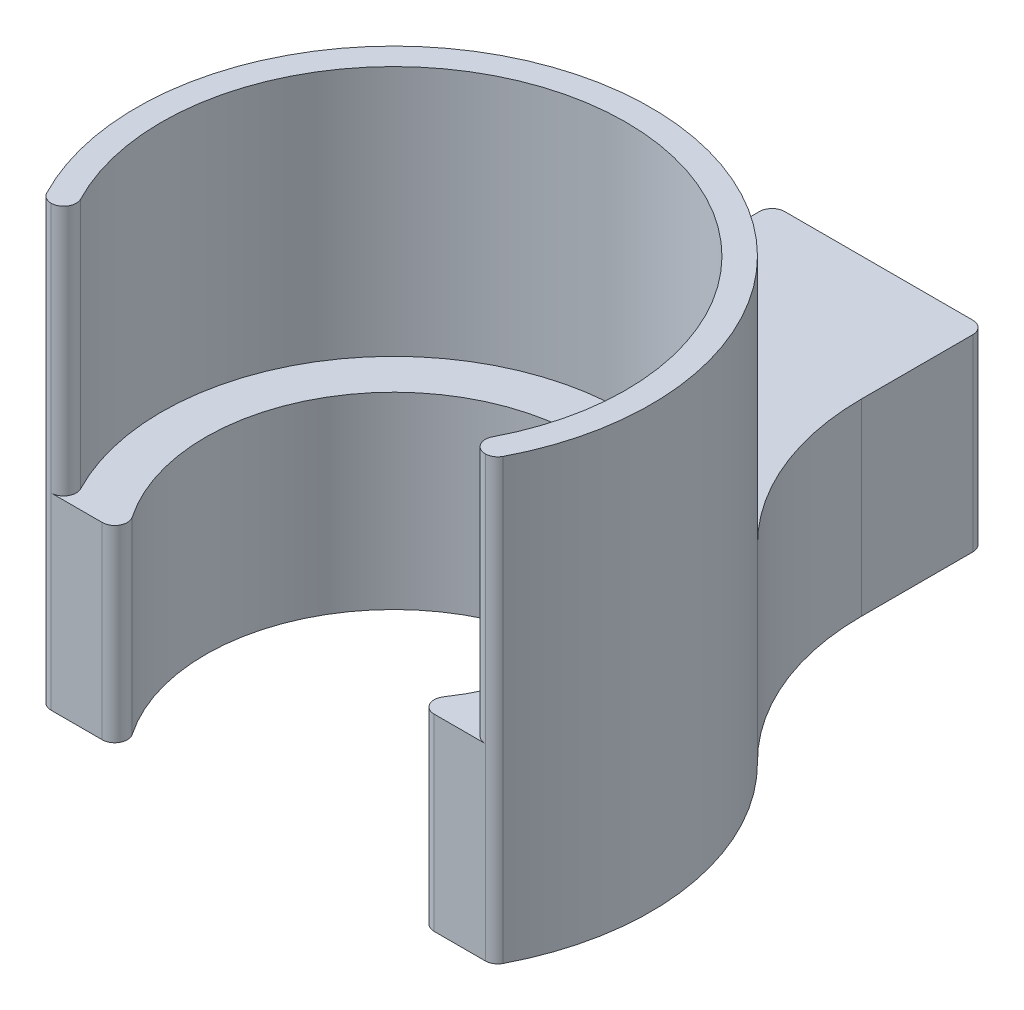
ISO-10303-21;
HEADER;
FILE_DESCRIPTION(('STEP AP214'),'2;1');
FILE_NAME('part.step','',(''),(''),'','','');
FILE_SCHEMA(('AUTOMOTIVE_DESIGN { 1 0 10303 214 1 1 1 1 }'));
ENDSEC;
DATA;
#1=APPLICATION_CONTEXT('core data for automotive mechanical design processes');
#2=APPLICATION_PROTOCOL_DEFINITION('international standard','automotive_design',2000,#1);
#3=PRODUCT_CONTEXT('',#1,'mechanical');
#4=PRODUCT('Part','Part','',(#3));
#5=PRODUCT_RELATED_PRODUCT_CATEGORY('part','',(#4));
#6=PRODUCT_DEFINITION_FORMATION('','',#4);
#7=PRODUCT_DEFINITION_CONTEXT('part definition',#1,'design');
#8=PRODUCT_DEFINITION('design','',#6,#7);
#9=PRODUCT_DEFINITION_SHAPE('','',#8);
#10=(LENGTH_UNIT() NAMED_UNIT(*) SI_UNIT(.MILLI.,.METRE.));
#11=(NAMED_UNIT(*) PLANE_ANGLE_UNIT() SI_UNIT($,.RADIAN.));
#12=(NAMED_UNIT(*) SI_UNIT($,.STERADIAN.) SOLID_ANGLE_UNIT());
#13=UNCERTAINTY_MEASURE_WITH_UNIT(LENGTH_MEASURE(1.E-05),#10,'distance_accuracy_value','');
#14=(GEOMETRIC_REPRESENTATION_CONTEXT(3) GLOBAL_UNCERTAINTY_ASSIGNED_CONTEXT((#13)) GLOBAL_UNIT_ASSIGNED_CONTEXT((#10,
#11,#12)) REPRESENTATION_CONTEXT('',''));
#15=CARTESIAN_POINT('',(0.,0.,0.));
#16=DIRECTION('',(0.,0.,1.));
#17=DIRECTION('',(1.,0.,0.));
#18=AXIS2_PLACEMENT_3D('',#15,#16,#17);
#19=CARTESIAN_POINT('',(8.5,-7.5,20.));
#20=DIRECTION('',(-1.,0.,0.));
#21=DIRECTION('',(0.,0.,1.));
#22=AXIS2_PLACEMENT_3D('',#19,#20,#21);
#23=PLANE('',#22);
#24=DIRECTION('',(0.,0.,-1.));
#25=VECTOR('',#24,1.);
#26=CARTESIAN_POINT('',(8.5,-7.5,20.));
#27=LINE('',#26,#25);
#28=CARTESIAN_POINT('',(8.5,-7.5,9.87976896630131));
#29=VERTEX_POINT('',#28);
#30=CARTESIAN_POINT('',(8.5,-7.5,1.));
#31=VERTEX_POINT('',#30);
#32=EDGE_CURVE('E207',#29,#31,#27,.T.);
#33=ORIENTED_EDGE('',*,*,#32,.T.);
#34=DIRECTION('',(0.,1.,0.));
#35=VECTOR('',#34,1.);
#36=CARTESIAN_POINT('',(8.5,7.5,1.));
#37=LINE('',#36,#35);
#38=CARTESIAN_POINT('',(8.5,7.5,1.));
#39=VERTEX_POINT('',#38);
#40=EDGE_CURVE('E337',#31,#39,#37,.T.);
#41=ORIENTED_EDGE('',*,*,#40,.T.);
#42=DIRECTION('',(0.,0.,-1.));
#43=VECTOR('',#42,1.);
#44=CARTESIAN_POINT('',(8.5,7.5,20.));
#45=LINE('',#44,#43);
#46=CARTESIAN_POINT('',(8.5,7.5,9.87976896630131));
#47=VERTEX_POINT('',#46);
#48=EDGE_CURVE('E219',#47,#39,#45,.T.);
#49=ORIENTED_EDGE('',*,*,#48,.F.);
#50=DIRECTION('',(0.,1.,0.));
#51=VECTOR('',#50,1.);
#52=CARTESIAN_POINT('',(8.5,-7.5,9.87976896630131));
#53=LINE('',#52,#51);
#54=EDGE_CURVE('E235',#47,#29,#53,.F.);
#55=ORIENTED_EDGE('',*,*,#54,.T.);
#56=EDGE_LOOP('',(#33,#41,#49,#55));
#57=FACE_BOUND('',#56,.T.);
#58=ADVANCED_FACE('F43',(#57),#23,.F.);
#59=CARTESIAN_POINT('',(-8.5,7.5,20.));
#60=DIRECTION('',(0.,-1.,0.));
#61=DIRECTION('',(0.,0.,-1.));
#62=AXIS2_PLACEMENT_3D('',#59,#60,#61);
#63=PLANE('',#62);
#64=DIRECTION('',(-1.,0.,0.));
#65=VECTOR('',#64,1.);
#66=CARTESIAN_POINT('',(-8.5,7.5,0.));
#67=LINE('',#66,#65);
#68=CARTESIAN_POINT('',(7.5,7.5,0.));
#69=VERTEX_POINT('',#68);
#70=CARTESIAN_POINT('',(-7.5,7.5,0.));
#71=VERTEX_POINT('',#70);
#72=EDGE_CURVE('E192',#69,#71,#67,.T.);
#73=ORIENTED_EDGE('',*,*,#72,.T.);
#74=CARTESIAN_POINT('',(-7.5,7.5,1.));
#75=DIRECTION('',(0.,-1.,0.));
#76=DIRECTION('',(0.,0.,-1.));
#77=AXIS2_PLACEMENT_3D('',#74,#75,#76);
#78=CIRCLE('',#77,1.);
#79=CARTESIAN_POINT('',(-8.5,7.5,1.));
#80=VERTEX_POINT('',#79);
#81=EDGE_CURVE('E334',#71,#80,#78,.F.);
#82=ORIENTED_EDGE('',*,*,#81,.T.);
#83=DIRECTION('',(0.,0.,-1.));
#84=VECTOR('',#83,1.);
#85=CARTESIAN_POINT('',(-8.5,7.5,20.));
#86=LINE('',#85,#84);
#87=CARTESIAN_POINT('',(-8.5,7.5,9.87976896630131));
#88=VERTEX_POINT('',#87);
#89=EDGE_CURVE('E215',#88,#80,#86,.T.);
#90=ORIENTED_EDGE('',*,*,#89,.F.);
#91=CARTESIAN_POINT('',(-28.5,7.5,9.87976896630131));
#92=DIRECTION('',(0.,-1.,0.));
#93=DIRECTION('',(0.,0.,-1.));
#94=AXIS2_PLACEMENT_3D('',#91,#92,#93);
#95=CIRCLE('',#94,20.);
#96=CARTESIAN_POINT('',(-14.4259259259259,7.5,24.0896401464871));
#97=VERTEX_POINT('',#96);
#98=EDGE_CURVE('E241',#88,#97,#95,.T.);
#99=ORIENTED_EDGE('',*,*,#98,.T.);
#100=CARTESIAN_POINT('',(0.,7.5,38.6547581061776));
#101=DIRECTION('',(0.,1.,0.));
#102=DIRECTION('',(0.,0.,1.));
#103=AXIS2_PLACEMENT_3D('',#100,#101,#102);
#104=CIRCLE('',#103,20.5);
#105=CARTESIAN_POINT('',(14.4259259259259,7.5,24.0896401464871));
#106=VERTEX_POINT('',#105);
#107=EDGE_CURVE('E223',#106,#97,#104,.T.);
#108=ORIENTED_EDGE('',*,*,#107,.F.);
#109=CARTESIAN_POINT('',(28.5,7.5,9.87976896630131));
#110=DIRECTION('',(0.,-1.,0.));
#111=DIRECTION('',(0.,0.,-1.));
#112=AXIS2_PLACEMENT_3D('',#109,#110,#111);
#113=CIRCLE('',#112,20.);
#114=EDGE_CURVE('E245',#106,#47,#113,.T.);
#115=ORIENTED_EDGE('',*,*,#114,.T.);
#116=ORIENTED_EDGE('',*,*,#48,.T.);
#117=CARTESIAN_POINT('',(7.5,7.5,1.));
#118=DIRECTION('',(0.,-1.,0.));
#119=DIRECTION('',(0.,0.,-1.));
#120=AXIS2_PLACEMENT_3D('',#117,#118,#119);
#121=CIRCLE('',#120,1.);
#122=EDGE_CURVE('E61',#39,#69,#121,.F.);
#123=ORIENTED_EDGE('',*,*,#122,.T.);
#124=EDGE_LOOP('',(#73,#82,#90,#99,#108,#115,#116,#123));
#125=FACE_BOUND('',#124,.T.);
#126=ADVANCED_FACE('F423',(#125),#63,.F.);
#127=CARTESIAN_POINT('',(-8.5,-7.5,20.));
#128=DIRECTION('',(1.,0.,0.));
#129=DIRECTION('',(0.,0.,-1.));
#130=AXIS2_PLACEMENT_3D('',#127,#128,#129);
#131=PLANE('',#130);
#132=ORIENTED_EDGE('',*,*,#89,.T.);
#133=DIRECTION('',(0.,-1.,0.));
#134=VECTOR('',#133,1.);
#135=CARTESIAN_POINT('',(-8.5,-7.5,1.));
#136=LINE('',#135,#134);
#137=CARTESIAN_POINT('',(-8.5,-7.5,1.));
#138=VERTEX_POINT('',#137);
#139=EDGE_CURVE('E323',#80,#138,#136,.T.);
#140=ORIENTED_EDGE('',*,*,#139,.T.);
#141=DIRECTION('',(0.,0.,-1.));
#142=VECTOR('',#141,1.);
#143=CARTESIAN_POINT('',(-8.5,-7.5,20.));
#144=LINE('',#143,#142);
#145=CARTESIAN_POINT('',(-8.5,-7.5,9.87976896630131));
#146=VERTEX_POINT('',#145);
#147=EDGE_CURVE('E211',#146,#138,#144,.T.);
#148=ORIENTED_EDGE('',*,*,#147,.F.);
#149=DIRECTION('',(0.,1.,0.));
#150=VECTOR('',#149,1.);
#151=CARTESIAN_POINT('',(-8.5,7.5,9.87976896630131));
#152=LINE('',#151,#150);
#153=EDGE_CURVE('E232',#146,#88,#152,.T.);
#154=ORIENTED_EDGE('',*,*,#153,.T.);
#155=EDGE_LOOP('',(#132,#140,#148,#154));
#156=FACE_BOUND('',#155,.T.);
#157=ADVANCED_FACE('F429',(#156),#131,.F.);
#158=CARTESIAN_POINT('',(-8.5,-7.5,20.));
#159=DIRECTION('',(0.,1.,0.));
#160=DIRECTION('',(0.,0.,1.));
#161=AXIS2_PLACEMENT_3D('',#158,#159,#160);
#162=PLANE('',#161);
#163=CARTESIAN_POINT('',(0.,-7.5,38.6547581061776));
#164=DIRECTION('',(0.,1.,0.));
#165=DIRECTION('',(0.,0.,1.));
#166=AXIS2_PLACEMENT_3D('',#163,#164,#165);
#167=CIRCLE('',#166,20.5);
#168=CARTESIAN_POINT('',(18.1859640915963,-7.5,48.1162965677161));
#169=VERTEX_POINT('',#168);
#170=CARTESIAN_POINT('',(14.4259259259259,-7.5,24.0896401464871));
#171=VERTEX_POINT('',#170);
#172=EDGE_CURVE('E395',#169,#171,#167,.T.);
#173=ORIENTED_EDGE('',*,*,#172,.F.);
#174=CARTESIAN_POINT('',(17.2988438920062,-7.5,47.6547581061776));
#175=DIRECTION('',(0.,1.,0.));
#176=DIRECTION('',(0.,0.,1.));
#177=AXIS2_PLACEMENT_3D('',#174,#175,#176);
#178=CIRCLE('',#177,1.);
#179=CARTESIAN_POINT('',(17.2988438920062,-7.5,48.6547581061776));
#180=VERTEX_POINT('',#179);
#181=EDGE_CURVE('E274',#169,#180,#178,.F.);
#182=ORIENTED_EDGE('',*,*,#181,.T.);
#183=DIRECTION('',(1.,0.,0.));
#184=VECTOR('',#183,1.);
#185=CARTESIAN_POINT('',(15.5643824162734,-7.5,48.6547581061776));
#186=LINE('',#185,#184);
#187=CARTESIAN_POINT('',(13.228756555323,-7.5,48.6547581061776));
#188=VERTEX_POINT('',#187);
#189=EDGE_CURVE('E388',#188,#180,#186,.T.);
#190=ORIENTED_EDGE('',*,*,#189,.F.);
#191=CARTESIAN_POINT('',(13.228756555323,-7.5,47.6547581061776));
#192=DIRECTION('',(0.,1.,0.));
#193=DIRECTION('',(0.,0.,1.));
#194=AXIS2_PLACEMENT_3D('',#191,#192,#193);
#195=CIRCLE('',#194,1.);
#196=CARTESIAN_POINT('',(12.4019592706153,-7.5,47.0922581061776));
#197=VERTEX_POINT('',#196);
#198=EDGE_CURVE('E271',#188,#197,#195,.F.);
#199=ORIENTED_EDGE('',*,*,#198,.T.);
#200=CARTESIAN_POINT('',(0.,-7.5,38.6547581061776));
#201=DIRECTION('',(0.,1.,0.));
#202=DIRECTION('',(0.,0.,1.));
#203=AXIS2_PLACEMENT_3D('',#200,#201,#202);
#204=CIRCLE('',#203,15.);
#205=CARTESIAN_POINT('',(-12.4019592706153,-7.5,47.0922581061776));
#206=VERTEX_POINT('',#205);
#207=EDGE_CURVE('E382',#206,#197,#204,.F.);
#208=ORIENTED_EDGE('',*,*,#207,.F.);
#209=CARTESIAN_POINT('',(-13.228756555323,-7.5,47.6547581061776));
#210=DIRECTION('',(0.,1.,0.));
#211=DIRECTION('',(0.,0.,1.));
#212=AXIS2_PLACEMENT_3D('',#209,#210,#211);
#213=CIRCLE('',#212,1.);
#214=CARTESIAN_POINT('',(-13.228756555323,-7.5,48.6547581061776));
#215=VERTEX_POINT('',#214);
#216=EDGE_CURVE('E268',#206,#215,#213,.F.);
#217=ORIENTED_EDGE('',*,*,#216,.T.);
#218=DIRECTION('',(1.,0.,0.));
#219=VECTOR('',#218,1.);
#220=CARTESIAN_POINT('',(-15.5643824162734,-7.5,48.6547581061776));
#221=LINE('',#220,#219);
#222=CARTESIAN_POINT('',(-17.2988438920062,-7.5,48.6547581061776));
#223=VERTEX_POINT('',#222);
#224=EDGE_CURVE('E370',#223,#215,#221,.T.);
#225=ORIENTED_EDGE('',*,*,#224,.F.);
#226=CARTESIAN_POINT('',(-17.2988438920062,-7.5,47.6547581061776));
#227=DIRECTION('',(0.,1.,0.));
#228=DIRECTION('',(0.,0.,1.));
#229=AXIS2_PLACEMENT_3D('',#226,#227,#228);
#230=CIRCLE('',#229,1.);
#231=CARTESIAN_POINT('',(-18.1859640915963,-7.5,48.1162965677161));
#232=VERTEX_POINT('',#231);
#233=EDGE_CURVE('E265',#223,#232,#230,.F.);
#234=ORIENTED_EDGE('',*,*,#233,.T.);
#235=CARTESIAN_POINT('',(0.,-7.5,38.6547581061776));
#236=DIRECTION('',(0.,1.,0.));
#237=DIRECTION('',(0.,0.,1.));
#238=AXIS2_PLACEMENT_3D('',#235,#236,#237);
#239=CIRCLE('',#238,20.5);
#240=CARTESIAN_POINT('',(-14.4259259259259,-7.5,24.0896401464871));
#241=VERTEX_POINT('',#240);
#242=EDGE_CURVE('E383',#241,#232,#239,.T.);
#243=ORIENTED_EDGE('',*,*,#242,.F.);
#244=CARTESIAN_POINT('',(-28.5,-7.5,9.87976896630131));
#245=DIRECTION('',(0.,1.,0.));
#246=DIRECTION('',(0.,0.,1.));
#247=AXIS2_PLACEMENT_3D('',#244,#245,#246);
#248=CIRCLE('',#247,20.);
#249=EDGE_CURVE('E238',#241,#146,#248,.T.);
#250=ORIENTED_EDGE('',*,*,#249,.T.);
#251=ORIENTED_EDGE('',*,*,#147,.T.);
#252=CARTESIAN_POINT('',(-7.5,-7.5,1.));
#253=DIRECTION('',(0.,1.,0.));
#254=DIRECTION('',(0.,0.,1.));
#255=AXIS2_PLACEMENT_3D('',#252,#253,#254);
#256=CIRCLE('',#255,1.);
#257=CARTESIAN_POINT('',(-7.5,-7.5,0.));
#258=VERTEX_POINT('',#257);
#259=EDGE_CURVE('E262',#138,#258,#256,.F.);
#260=ORIENTED_EDGE('',*,*,#259,.T.);
#261=DIRECTION('',(1.,0.,0.));
#262=VECTOR('',#261,1.);
#263=CARTESIAN_POINT('',(-8.5,-7.5,0.));
#264=LINE('',#263,#262);
#265=CARTESIAN_POINT('',(7.5,-7.5,0.));
#266=VERTEX_POINT('',#265);
#267=EDGE_CURVE('E197',#258,#266,#264,.T.);
#268=ORIENTED_EDGE('',*,*,#267,.T.);
#269=CARTESIAN_POINT('',(7.5,-7.5,1.));
#270=DIRECTION('',(0.,1.,0.));
#271=DIRECTION('',(0.,0.,1.));
#272=AXIS2_PLACEMENT_3D('',#269,#270,#271);
#273=CIRCLE('',#272,1.);
#274=EDGE_CURVE('E259',#266,#31,#273,.F.);
#275=ORIENTED_EDGE('',*,*,#274,.T.);
#276=ORIENTED_EDGE('',*,*,#32,.F.);
#277=CARTESIAN_POINT('',(28.5,-7.5,9.87976896630131));
#278=DIRECTION('',(0.,1.,0.));
#279=DIRECTION('',(0.,0.,1.));
#280=AXIS2_PLACEMENT_3D('',#277,#278,#279);
#281=CIRCLE('',#280,20.);
#282=EDGE_CURVE('E248',#29,#171,#281,.T.);
#283=ORIENTED_EDGE('',*,*,#282,.T.);
#284=EDGE_LOOP('',(#173,#182,#190,#199,#208,#217,#225,#234,#243,#250,#251,#260,#268,#275,#276,#283));
#285=FACE_BOUND('',#284,.T.);
#286=ADVANCED_FACE('F376',(#285),#162,.F.);
#287=CARTESIAN_POINT('',(0.,0.,0.));
#288=DIRECTION('',(0.,0.,-1.));
#289=DIRECTION('',(-1.,0.,0.));
#290=AXIS2_PLACEMENT_3D('',#287,#288,#289);
#291=PLANE('',#290);
#292=CARTESIAN_POINT('',(0.,0.,0.));
#293=DIRECTION('',(0.,0.,-1.));
#294=DIRECTION('',(-1.,0.,0.));
#295=AXIS2_PLACEMENT_3D('',#292,#293,#294);
#296=CIRCLE('',#295,2.49999999999999);
#297=CARTESIAN_POINT('',(-2.49999999999999,0.,0.));
#298=VERTEX_POINT('',#297);
#299=EDGE_CURVE('E193',#298,#298,#296,.T.);
#300=ORIENTED_EDGE('',*,*,#299,.F.);
#301=EDGE_LOOP('',(#300));
#302=FACE_BOUND('',#301,.T.);
#303=ORIENTED_EDGE('',*,*,#267,.F.);
#304=DIRECTION('',(0.,-1.,0.));
#305=VECTOR('',#304,1.);
#306=CARTESIAN_POINT('',(-7.5,7.5,0.));
#307=LINE('',#306,#305);
#308=EDGE_CURVE('E69',#258,#71,#307,.F.);
#309=ORIENTED_EDGE('',*,*,#308,.T.);
#310=ORIENTED_EDGE('',*,*,#72,.F.);
#311=DIRECTION('',(0.,1.,0.));
#312=VECTOR('',#311,1.);
#313=CARTESIAN_POINT('',(7.5,-7.5,0.));
#314=LINE('',#313,#312);
#315=EDGE_CURVE('E327',#69,#266,#314,.F.);
#316=ORIENTED_EDGE('',*,*,#315,.T.);
#317=EDGE_LOOP('',(#303,#309,#310,#316));
#318=FACE_BOUND('',#317,.T.);
#319=ADVANCED_FACE('F185',(#302,#318),#291,.T.);
#320=CARTESIAN_POINT('',(0.,0.,10.));
#321=DIRECTION('',(0.,0.,-1.));
#322=DIRECTION('',(-1.,0.,0.));
#323=AXIS2_PLACEMENT_3D('',#320,#321,#322);
#324=CONICAL_SURFACE('',#323,2.5,1.02974425867665);
#325=CARTESIAN_POINT('',(0.,0.,11.5021515475689));
#326=VERTEX_POINT('',#325);
#327=VERTEX_LOOP('',#326);
#328=FACE_BOUND('',#327,.T.);
#329=CARTESIAN_POINT('',(0.,0.,10.));
#330=DIRECTION('',(0.,0.,-1.));
#331=DIRECTION('',(-1.,0.,0.));
#332=AXIS2_PLACEMENT_3D('',#329,#330,#331);
#333=CIRCLE('',#332,2.5);
#334=CARTESIAN_POINT('',(-2.5,0.,10.));
#335=VERTEX_POINT('',#334);
#336=EDGE_CURVE('E189',#335,#335,#333,.T.);
#337=ORIENTED_EDGE('',*,*,#336,.T.);
#338=EDGE_LOOP('',(#337));
#339=FACE_BOUND('',#338,.T.);
#340=ADVANCED_FACE('F181',(#328,#339),#324,.F.);
#341=CARTESIAN_POINT('',(0.,0.,0.));
#342=DIRECTION('',(0.,0.,-1.));
#343=DIRECTION('',(-1.,0.,0.));
#344=AXIS2_PLACEMENT_3D('',#341,#342,#343);
#345=CYLINDRICAL_SURFACE('',#344,2.49999999999999);
#346=ORIENTED_EDGE('',*,*,#336,.F.);
#347=EDGE_LOOP('',(#346));
#348=FACE_BOUND('',#347,.T.);
#349=ORIENTED_EDGE('',*,*,#299,.T.);
#350=EDGE_LOOP('',(#349));
#351=FACE_BOUND('',#350,.T.);
#352=ADVANCED_FACE('F184',(#348,#351),#345,.F.);
#353=CARTESIAN_POINT('',(0.,27.5,38.6547581061776));
#354=DIRECTION('',(0.,-1.,0.));
#355=DIRECTION('',(0.,0.,-1.));
#356=AXIS2_PLACEMENT_3D('',#353,#354,#355);
#357=CYLINDRICAL_SURFACE('',#356,18.5);
#358=CARTESIAN_POINT('',(0.,7.5,38.6547581061776));
#359=DIRECTION('',(0.,-1.,0.));
#360=DIRECTION('',(0.,0.,1.));
#361=AXIS2_PLACEMENT_3D('',#358,#359,#360);
#362=CIRCLE('',#361,18.5);
#363=CARTESIAN_POINT('',(-16.4117236924161,7.5,47.1932196446392));
#364=VERTEX_POINT('',#363);
#365=CARTESIAN_POINT('',(16.4117236924161,7.5,47.1932196446392));
#366=VERTEX_POINT('',#365);
#367=EDGE_CURVE('E397',#364,#366,#362,.T.);
#368=ORIENTED_EDGE('',*,*,#367,.T.);
#369=DIRECTION('',(0.,-1.,0.));
#370=VECTOR('',#369,1.);
#371=CARTESIAN_POINT('',(16.4117236924161,27.5,47.1932196446392));
#372=LINE('',#371,#370);
#373=CARTESIAN_POINT('',(16.4117236924161,27.5,47.1932196446392));
#374=VERTEX_POINT('',#373);
#375=EDGE_CURVE('E300',#366,#374,#372,.F.);
#376=ORIENTED_EDGE('',*,*,#375,.T.);
#377=CARTESIAN_POINT('',(0.,27.5,38.6547581061776));
#378=DIRECTION('',(0.,-1.,0.));
#379=DIRECTION('',(0.,0.,1.));
#380=AXIS2_PLACEMENT_3D('',#377,#378,#379);
#381=CIRCLE('',#380,18.5);
#382=CARTESIAN_POINT('',(-16.4117236924161,27.5,47.1932196446392));
#383=VERTEX_POINT('',#382);
#384=EDGE_CURVE('E404',#383,#374,#381,.T.);
#385=ORIENTED_EDGE('',*,*,#384,.F.);
#386=DIRECTION('',(0.,-1.,0.));
#387=VECTOR('',#386,1.);
#388=CARTESIAN_POINT('',(-16.4117236924161,27.5,47.1932196446392));
#389=LINE('',#388,#387);
#390=EDGE_CURVE('E296',#383,#364,#389,.T.);
#391=ORIENTED_EDGE('',*,*,#390,.T.);
#392=EDGE_LOOP('',(#368,#376,#385,#391));
#393=FACE_BOUND('',#392,.T.);
#394=ADVANCED_FACE('F458',(#393),#357,.F.);
#395=CARTESIAN_POINT('',(15.5643824162734,27.5,48.6547581061776));
#396=DIRECTION('',(0.,0.,-1.));
#397=DIRECTION('',(-1.,0.,0.));
#398=AXIS2_PLACEMENT_3D('',#395,#396,#397);
#399=PLANE('',#398);
#400=ORIENTED_EDGE('',*,*,#189,.T.);
#401=DIRECTION('',(0.,-1.,0.));
#402=VECTOR('',#401,1.);
#403=CARTESIAN_POINT('',(17.2988438920062,27.5,48.6547581061776));
#404=LINE('',#403,#402);
#405=CARTESIAN_POINT('',(17.2988438920062,7.5,48.6547581061776));
#406=VERTEX_POINT('',#405);
#407=EDGE_CURVE('E280',#180,#406,#404,.F.);
#408=ORIENTED_EDGE('',*,*,#407,.T.);
#409=DIRECTION('',(-1.,0.,0.));
#410=VECTOR('',#409,1.);
#411=CARTESIAN_POINT('',(15.5643824162734,7.5,48.6547581061776));
#412=LINE('',#411,#410);
#413=CARTESIAN_POINT('',(13.228756555323,7.5,48.6547581061776));
#414=VERTEX_POINT('',#413);
#415=EDGE_CURVE('E344',#406,#414,#412,.T.);
#416=ORIENTED_EDGE('',*,*,#415,.T.);
#417=DIRECTION('',(0.,1.,0.));
#418=VECTOR('',#417,1.);
#419=CARTESIAN_POINT('',(13.228756555323,27.5,48.6547581061776));
#420=LINE('',#419,#418);
#421=EDGE_CURVE('E277',#414,#188,#420,.F.);
#422=ORIENTED_EDGE('',*,*,#421,.T.);
#423=EDGE_LOOP('',(#400,#408,#416,#422));
#424=FACE_BOUND('',#423,.T.);
#425=ADVANCED_FACE('F447',(#424),#399,.F.);
#426=CARTESIAN_POINT('',(0.,27.5,38.6547581061776));
#427=DIRECTION('',(0.,-1.,0.));
#428=DIRECTION('',(0.,0.,-1.));
#429=AXIS2_PLACEMENT_3D('',#426,#427,#428);
#430=CYLINDRICAL_SURFACE('',#429,20.5);
#431=CARTESIAN_POINT('',(0.,27.5,38.6547581061776));
#432=DIRECTION('',(0.,1.,0.));
#433=DIRECTION('',(0.,0.,1.));
#434=AXIS2_PLACEMENT_3D('',#431,#432,#433);
#435=CIRCLE('',#434,20.5);
#436=CARTESIAN_POINT('',(18.1859640915963,27.5,48.1162965677161));
#437=VERTEX_POINT('',#436);
#438=CARTESIAN_POINT('',(-18.1859640915963,27.5,48.1162965677161));
#439=VERTEX_POINT('',#438);
#440=EDGE_CURVE('E200',#437,#439,#435,.T.);
#441=ORIENTED_EDGE('',*,*,#440,.F.);
#442=DIRECTION('',(0.,-1.,0.));
#443=VECTOR('',#442,1.);
#444=CARTESIAN_POINT('',(18.1859640915963,27.5,48.1162965677161));
#445=LINE('',#444,#443);
#446=EDGE_CURVE('E255',#437,#169,#445,.T.);
#447=ORIENTED_EDGE('',*,*,#446,.T.);
#448=ORIENTED_EDGE('',*,*,#172,.T.);
#449=DIRECTION('',(0.,-1.,0.));
#450=VECTOR('',#449,1.);
#451=CARTESIAN_POINT('',(14.4259259259259,27.5,24.0896401464871));
#452=LINE('',#451,#450);
#453=EDGE_CURVE('E224',#171,#106,#452,.F.);
#454=ORIENTED_EDGE('',*,*,#453,.T.);
#455=ORIENTED_EDGE('',*,*,#107,.T.);
#456=DIRECTION('',(0.,-1.,0.));
#457=VECTOR('',#456,1.);
#458=CARTESIAN_POINT('',(-14.4259259259259,27.5,24.0896401464871));
#459=LINE('',#458,#457);
#460=EDGE_CURVE('E228',#97,#241,#459,.T.);
#461=ORIENTED_EDGE('',*,*,#460,.T.);
#462=ORIENTED_EDGE('',*,*,#242,.T.);
#463=DIRECTION('',(0.,-1.,0.));
#464=VECTOR('',#463,1.);
#465=CARTESIAN_POINT('',(-18.1859640915963,27.5,48.1162965677161));
#466=LINE('',#465,#464);
#467=EDGE_CURVE('E252',#232,#439,#466,.F.);
#468=ORIENTED_EDGE('',*,*,#467,.T.);
#469=EDGE_LOOP('',(#441,#447,#448,#454,#455,#461,#462,#468));
#470=FACE_BOUND('',#469,.T.);
#471=ADVANCED_FACE('F416',(#470),#430,.T.);
#472=CARTESIAN_POINT('',(-17.8955301681733,27.5,48.6547581061776));
#473=DIRECTION('',(0.,0.,-1.));
#474=DIRECTION('',(-1.,0.,0.));
#475=AXIS2_PLACEMENT_3D('',#472,#473,#474);
#476=PLANE('',#475);
#477=ORIENTED_EDGE('',*,*,#224,.T.);
#478=DIRECTION('',(0.,1.,0.));
#479=VECTOR('',#478,1.);
#480=CARTESIAN_POINT('',(-13.228756555323,27.5,48.6547581061776));
#481=LINE('',#480,#479);
#482=CARTESIAN_POINT('',(-13.228756555323,7.5,48.6547581061776));
#483=VERTEX_POINT('',#482);
#484=EDGE_CURVE('E319',#215,#483,#481,.T.);
#485=ORIENTED_EDGE('',*,*,#484,.T.);
#486=DIRECTION('',(-1.,0.,0.));
#487=VECTOR('',#486,1.);
#488=CARTESIAN_POINT('',(-15.5643824162734,7.5,48.6547581061776));
#489=LINE('',#488,#487);
#490=CARTESIAN_POINT('',(-17.2988438920062,7.5,48.6547581061776));
#491=VERTEX_POINT('',#490);
#492=EDGE_CURVE('E373',#483,#491,#489,.T.);
#493=ORIENTED_EDGE('',*,*,#492,.T.);
#494=DIRECTION('',(0.,-1.,0.));
#495=VECTOR('',#494,1.);
#496=CARTESIAN_POINT('',(-17.2988438920062,27.5,48.6547581061776));
#497=LINE('',#496,#495);
#498=EDGE_CURVE('E316',#491,#223,#497,.T.);
#499=ORIENTED_EDGE('',*,*,#498,.T.);
#500=EDGE_LOOP('',(#477,#485,#493,#499));
#501=FACE_BOUND('',#500,.T.);
#502=ADVANCED_FACE('F369',(#501),#476,.F.);
#503=CARTESIAN_POINT('',(0.,27.5,38.6547581061776));
#504=DIRECTION('',(0.,1.,0.));
#505=DIRECTION('',(0.,0.,1.));
#506=AXIS2_PLACEMENT_3D('',#503,#504,#505);
#507=PLANE('',#506);
#508=CARTESIAN_POINT('',(17.2988438920062,27.5,47.6547581061776));
#509=DIRECTION('',(0.,1.,0.));
#510=DIRECTION('',(0.,0.,1.));
#511=AXIS2_PLACEMENT_3D('',#508,#509,#510);
#512=CIRCLE('',#511,1.);
#513=CARTESIAN_POINT('',(17.2988438920062,27.5,48.6547581061776));
#514=VERTEX_POINT('',#513);
#515=EDGE_CURVE('E290',#374,#514,#512,.T.);
#516=ORIENTED_EDGE('',*,*,#515,.T.);
#517=CARTESIAN_POINT('',(17.2988438920062,27.5,47.6547581061776));
#518=DIRECTION('',(0.,1.,0.));
#519=DIRECTION('',(0.,0.,1.));
#520=AXIS2_PLACEMENT_3D('',#517,#518,#519);
#521=CIRCLE('',#520,1.);
#522=EDGE_CURVE('E293',#514,#437,#521,.T.);
#523=ORIENTED_EDGE('',*,*,#522,.T.);
#524=ORIENTED_EDGE('',*,*,#440,.T.);
#525=CARTESIAN_POINT('',(-17.2988438920062,27.5,47.6547581061776));
#526=DIRECTION('',(0.,1.,0.));
#527=DIRECTION('',(0.,0.,1.));
#528=AXIS2_PLACEMENT_3D('',#525,#526,#527);
#529=CIRCLE('',#528,1.);
#530=CARTESIAN_POINT('',(-17.2988438920062,27.5,48.6547581061776));
#531=VERTEX_POINT('',#530);
#532=EDGE_CURVE('E284',#439,#531,#529,.T.);
#533=ORIENTED_EDGE('',*,*,#532,.T.);
#534=CARTESIAN_POINT('',(-17.2988438920062,27.5,47.6547581061776));
#535=DIRECTION('',(0.,1.,0.));
#536=DIRECTION('',(0.,0.,1.));
#537=AXIS2_PLACEMENT_3D('',#534,#535,#536);
#538=CIRCLE('',#537,1.);
#539=EDGE_CURVE('E287',#531,#383,#538,.T.);
#540=ORIENTED_EDGE('',*,*,#539,.T.);
#541=ORIENTED_EDGE('',*,*,#384,.T.);
#542=EDGE_LOOP('',(#516,#523,#524,#533,#540,#541));
#543=FACE_BOUND('',#542,.T.);
#544=ADVANCED_FACE('F461',(#543),#507,.T.);
#545=CARTESIAN_POINT('',(0.,7.5,38.6547581061776));
#546=DIRECTION('',(0.,-1.,0.));
#547=DIRECTION('',(0.,0.,-1.));
#548=AXIS2_PLACEMENT_3D('',#545,#546,#547);
#549=PLANE('',#548);
#550=CARTESIAN_POINT('',(0.,7.5,38.6547581061776));
#551=DIRECTION('',(0.,1.,0.));
#552=DIRECTION('',(0.,0.,-1.));
#553=AXIS2_PLACEMENT_3D('',#550,#551,#552);
#554=CIRCLE('',#553,15.);
#555=CARTESIAN_POINT('',(12.4019592706153,7.5,47.0922581061776));
#556=VERTEX_POINT('',#555);
#557=CARTESIAN_POINT('',(-12.4019592706153,7.5,47.0922581061776));
#558=VERTEX_POINT('',#557);
#559=EDGE_CURVE('E352',#556,#558,#554,.T.);
#560=ORIENTED_EDGE('',*,*,#559,.F.);
#561=CARTESIAN_POINT('',(13.228756555323,7.5,47.6547581061776));
#562=DIRECTION('',(0.,-1.,0.));
#563=DIRECTION('',(0.,0.,-1.));
#564=AXIS2_PLACEMENT_3D('',#561,#562,#563);
#565=CIRCLE('',#564,1.);
#566=EDGE_CURVE('E313',#556,#414,#565,.F.);
#567=ORIENTED_EDGE('',*,*,#566,.T.);
#568=ORIENTED_EDGE('',*,*,#415,.F.);
#569=CARTESIAN_POINT('',(17.2988438920062,7.5,47.6547581061776));
#570=DIRECTION('',(0.,-1.,0.));
#571=DIRECTION('',(0.,0.,-1.));
#572=AXIS2_PLACEMENT_3D('',#569,#570,#571);
#573=CIRCLE('',#572,1.);
#574=EDGE_CURVE('E53',#406,#366,#573,.T.);
#575=ORIENTED_EDGE('',*,*,#574,.T.);
#576=ORIENTED_EDGE('',*,*,#367,.F.);
#577=CARTESIAN_POINT('',(-17.2988438920062,7.5,47.6547581061776));
#578=DIRECTION('',(0.,-1.,0.));
#579=DIRECTION('',(0.,0.,-1.));
#580=AXIS2_PLACEMENT_3D('',#577,#578,#579);
#581=CIRCLE('',#580,1.);
#582=EDGE_CURVE('E11',#364,#491,#581,.T.);
#583=ORIENTED_EDGE('',*,*,#582,.T.);
#584=ORIENTED_EDGE('',*,*,#492,.F.);
#585=CARTESIAN_POINT('',(-13.228756555323,7.5,47.6547581061776));
#586=DIRECTION('',(0.,-1.,0.));
#587=DIRECTION('',(0.,0.,-1.));
#588=AXIS2_PLACEMENT_3D('',#585,#586,#587);
#589=CIRCLE('',#588,1.);
#590=EDGE_CURVE('E310',#483,#558,#589,.F.);
#591=ORIENTED_EDGE('',*,*,#590,.T.);
#592=EDGE_LOOP('',(#560,#567,#568,#575,#576,#583,#584,#591));
#593=FACE_BOUND('',#592,.T.);
#594=ADVANCED_FACE('F456',(#593),#549,.F.);
#595=CARTESIAN_POINT('',(0.,-57.5209472333697,38.6547581061776));
#596=DIRECTION('',(0.,1.,0.));
#597=DIRECTION('',(0.,0.,1.));
#598=AXIS2_PLACEMENT_3D('',#595,#596,#597);
#599=CYLINDRICAL_SURFACE('',#598,15.);
#600=ORIENTED_EDGE('',*,*,#207,.T.);
#601=DIRECTION('',(0.,1.,0.));
#602=VECTOR('',#601,1.);
#603=CARTESIAN_POINT('',(12.4019592706153,-57.5209472333697,47.0922581061776));
#604=LINE('',#603,#602);
#605=EDGE_CURVE('E306',#197,#556,#604,.T.);
#606=ORIENTED_EDGE('',*,*,#605,.T.);
#607=ORIENTED_EDGE('',*,*,#559,.T.);
#608=DIRECTION('',(0.,1.,0.));
#609=VECTOR('',#608,1.);
#610=CARTESIAN_POINT('',(-12.4019592706153,-57.5209472333697,47.0922581061776));
#611=LINE('',#610,#609);
#612=EDGE_CURVE('E303',#558,#206,#611,.F.);
#613=ORIENTED_EDGE('',*,*,#612,.T.);
#614=EDGE_LOOP('',(#600,#606,#607,#613));
#615=FACE_BOUND('',#614,.T.);
#616=ADVANCED_FACE('F468',(#615),#599,.F.);
#617=CARTESIAN_POINT('',(-28.5,27.5,9.87976896630131));
#618=DIRECTION('',(0.,-1.,0.));
#619=DIRECTION('',(0.,0.,-1.));
#620=AXIS2_PLACEMENT_3D('',#617,#618,#619);
#621=CYLINDRICAL_SURFACE('',#620,20.);
#622=ORIENTED_EDGE('',*,*,#98,.F.);
#623=ORIENTED_EDGE('',*,*,#153,.F.);
#624=ORIENTED_EDGE('',*,*,#249,.F.);
#625=ORIENTED_EDGE('',*,*,#460,.F.);
#626=EDGE_LOOP('',(#622,#623,#624,#625));
#627=FACE_BOUND('',#626,.T.);
#628=ADVANCED_FACE('F426',(#627),#621,.F.);
#629=CARTESIAN_POINT('',(28.5,27.5,9.87976896630131));
#630=DIRECTION('',(0.,-1.,0.));
#631=DIRECTION('',(0.,0.,-1.));
#632=AXIS2_PLACEMENT_3D('',#629,#630,#631);
#633=CYLINDRICAL_SURFACE('',#632,20.);
#634=ORIENTED_EDGE('',*,*,#282,.F.);
#635=ORIENTED_EDGE('',*,*,#54,.F.);
#636=ORIENTED_EDGE('',*,*,#114,.F.);
#637=ORIENTED_EDGE('',*,*,#453,.F.);
#638=EDGE_LOOP('',(#634,#635,#636,#637));
#639=FACE_BOUND('',#638,.T.);
#640=ADVANCED_FACE('F441',(#639),#633,.F.);
#641=CARTESIAN_POINT('',(17.2988438920062,27.5,47.6547581061776));
#642=DIRECTION('',(0.,-1.,0.));
#643=DIRECTION('',(0.,0.,-1.));
#644=AXIS2_PLACEMENT_3D('',#641,#642,#643);
#645=CYLINDRICAL_SURFACE('',#644,1.);
#646=ORIENTED_EDGE('',*,*,#375,.F.);
#647=ORIENTED_EDGE('',*,*,#574,.F.);
#648=DIRECTION('',(0.,-1.,0.));
#649=VECTOR('',#648,1.);
#650=CARTESIAN_POINT('',(17.2988438920062,27.5,48.6547581061776));
#651=LINE('',#650,#649);
#652=EDGE_CURVE('E341',#514,#406,#651,.T.);
#653=ORIENTED_EDGE('',*,*,#652,.F.);
#654=ORIENTED_EDGE('',*,*,#515,.F.);
#655=EDGE_LOOP('',(#646,#647,#653,#654));
#656=FACE_BOUND('',#655,.T.);
#657=ADVANCED_FACE('F451',(#656),#645,.T.);
#658=CARTESIAN_POINT('',(17.2988438920062,27.5,47.6547581061776));
#659=DIRECTION('',(0.,-1.,0.));
#660=DIRECTION('',(0.,0.,-1.));
#661=AXIS2_PLACEMENT_3D('',#658,#659,#660);
#662=CYLINDRICAL_SURFACE('',#661,1.);
#663=ORIENTED_EDGE('',*,*,#652,.T.);
#664=ORIENTED_EDGE('',*,*,#407,.F.);
#665=ORIENTED_EDGE('',*,*,#181,.F.);
#666=ORIENTED_EDGE('',*,*,#446,.F.);
#667=ORIENTED_EDGE('',*,*,#522,.F.);
#668=EDGE_LOOP('',(#663,#664,#665,#666,#667));
#669=FACE_BOUND('',#668,.T.);
#670=ADVANCED_FACE('F444',(#669),#662,.T.);
#671=CARTESIAN_POINT('',(13.228756555323,-57.5209472333697,47.6547581061776));
#672=DIRECTION('',(0.,1.,0.));
#673=DIRECTION('',(0.,0.,1.));
#674=AXIS2_PLACEMENT_3D('',#671,#672,#673);
#675=CYLINDRICAL_SURFACE('',#674,1.);
#676=ORIENTED_EDGE('',*,*,#198,.F.);
#677=ORIENTED_EDGE('',*,*,#421,.F.);
#678=ORIENTED_EDGE('',*,*,#566,.F.);
#679=ORIENTED_EDGE('',*,*,#605,.F.);
#680=EDGE_LOOP('',(#676,#677,#678,#679));
#681=FACE_BOUND('',#680,.T.);
#682=ADVANCED_FACE('F486',(#681),#675,.T.);
#683=CARTESIAN_POINT('',(-13.228756555323,-57.5209472333697,47.6547581061776));
#684=DIRECTION('',(0.,1.,0.));
#685=DIRECTION('',(0.,0.,1.));
#686=AXIS2_PLACEMENT_3D('',#683,#684,#685);
#687=CYLINDRICAL_SURFACE('',#686,1.);
#688=ORIENTED_EDGE('',*,*,#216,.F.);
#689=ORIENTED_EDGE('',*,*,#612,.F.);
#690=ORIENTED_EDGE('',*,*,#590,.F.);
#691=ORIENTED_EDGE('',*,*,#484,.F.);
#692=EDGE_LOOP('',(#688,#689,#690,#691));
#693=FACE_BOUND('',#692,.T.);
#694=ADVANCED_FACE('F491',(#693),#687,.T.);
#695=CARTESIAN_POINT('',(-17.2988438920062,27.5,47.6547581061776));
#696=DIRECTION('',(0.,-1.,0.));
#697=DIRECTION('',(0.,0.,-1.));
#698=AXIS2_PLACEMENT_3D('',#695,#696,#697);
#699=CYLINDRICAL_SURFACE('',#698,1.);
#700=DIRECTION('',(0.,-1.,0.));
#701=VECTOR('',#700,1.);
#702=CARTESIAN_POINT('',(-17.2988438920062,27.5,48.6547581061776));
#703=LINE('',#702,#701);
#704=EDGE_CURVE('E47',#531,#491,#703,.T.);
#705=ORIENTED_EDGE('',*,*,#704,.F.);
#706=ORIENTED_EDGE('',*,*,#532,.F.);
#707=ORIENTED_EDGE('',*,*,#467,.F.);
#708=ORIENTED_EDGE('',*,*,#233,.F.);
#709=ORIENTED_EDGE('',*,*,#498,.F.);
#710=EDGE_LOOP('',(#705,#706,#707,#708,#709));
#711=FACE_BOUND('',#710,.T.);
#712=ADVANCED_FACE('F363',(#711),#699,.T.);
#713=CARTESIAN_POINT('',(-17.2988438920062,27.5,47.6547581061776));
#714=DIRECTION('',(0.,-1.,0.));
#715=DIRECTION('',(0.,0.,-1.));
#716=AXIS2_PLACEMENT_3D('',#713,#714,#715);
#717=CYLINDRICAL_SURFACE('',#716,1.);
#718=ORIENTED_EDGE('',*,*,#539,.F.);
#719=ORIENTED_EDGE('',*,*,#704,.T.);
#720=ORIENTED_EDGE('',*,*,#582,.F.);
#721=ORIENTED_EDGE('',*,*,#390,.F.);
#722=EDGE_LOOP('',(#718,#719,#720,#721));
#723=FACE_BOUND('',#722,.T.);
#724=ADVANCED_FACE('F358',(#723),#717,.T.);
#725=CARTESIAN_POINT('',(-7.5,-7.5,1.));
#726=DIRECTION('',(0.,1.,0.));
#727=DIRECTION('',(0.,0.,1.));
#728=AXIS2_PLACEMENT_3D('',#725,#726,#727);
#729=CYLINDRICAL_SURFACE('',#728,1.);
#730=ORIENTED_EDGE('',*,*,#81,.F.);
#731=ORIENTED_EDGE('',*,*,#308,.F.);
#732=ORIENTED_EDGE('',*,*,#259,.F.);
#733=ORIENTED_EDGE('',*,*,#139,.F.);
#734=EDGE_LOOP('',(#730,#731,#732,#733));
#735=FACE_BOUND('',#734,.T.);
#736=ADVANCED_FACE('F433',(#735),#729,.T.);
#737=CARTESIAN_POINT('',(7.5,-7.5,1.));
#738=DIRECTION('',(0.,-1.,0.));
#739=DIRECTION('',(0.,0.,-1.));
#740=AXIS2_PLACEMENT_3D('',#737,#738,#739);
#741=CYLINDRICAL_SURFACE('',#740,1.);
#742=ORIENTED_EDGE('',*,*,#274,.F.);
#743=ORIENTED_EDGE('',*,*,#315,.F.);
#744=ORIENTED_EDGE('',*,*,#122,.F.);
#745=ORIENTED_EDGE('',*,*,#40,.F.);
#746=EDGE_LOOP('',(#742,#743,#744,#745));
#747=FACE_BOUND('',#746,.T.);
#748=ADVANCED_FACE('F45',(#747),#741,.T.);
#749=CLOSED_SHELL('',(#58,#126,#157,#286,#319,#340,#352,#394,#425,#471,#502,#544,#594,#616,#628,
#640,#657,#670,#682,#694,#712,#724,#736,#748));
#750=MANIFOLD_SOLID_BREP('B2',#749);
#751=ADVANCED_BREP_SHAPE_REPRESENTATION('',(#18,#750),#14);
#752=SHAPE_DEFINITION_REPRESENTATION(#9,#751);
ENDSEC;
END-ISO-10303-21;
